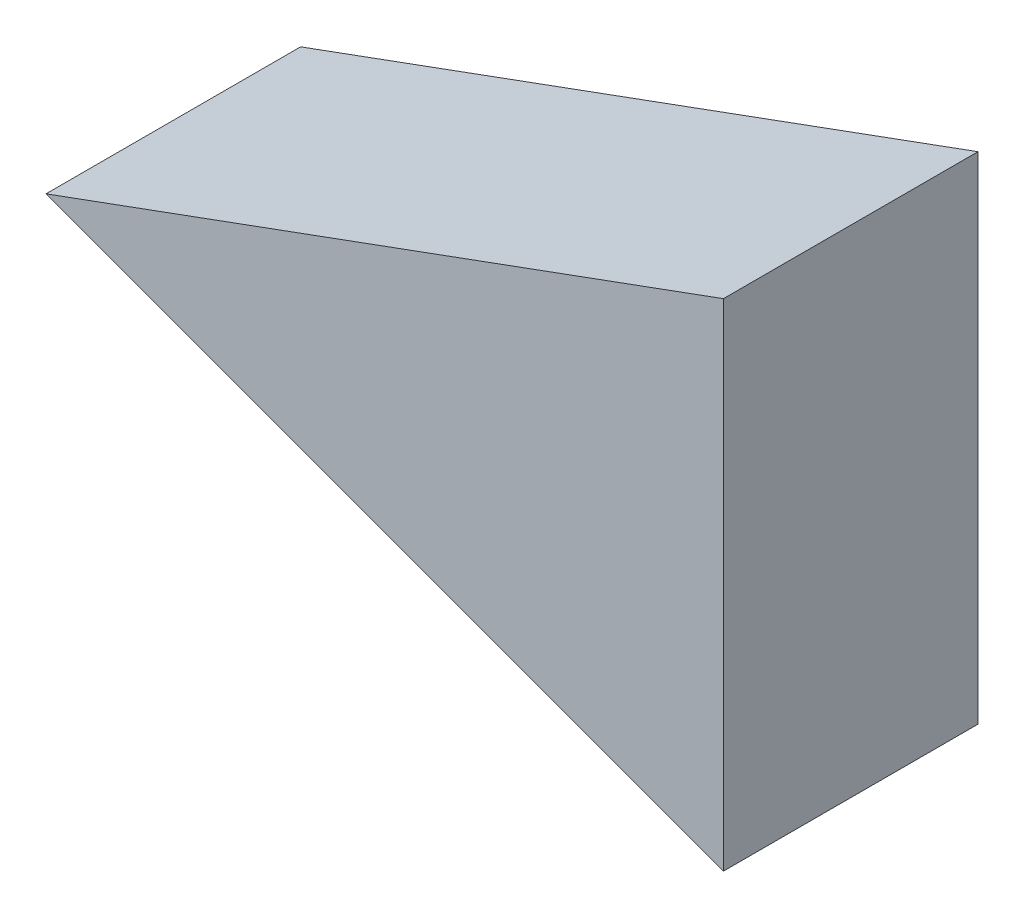
ISO-10303-21;
HEADER;
FILE_DESCRIPTION(('STEP AP214'),'2;1');
FILE_NAME('part.step','',(''),(''),'','','');
FILE_SCHEMA(('AUTOMOTIVE_DESIGN { 1 0 10303 214 1 1 1 1 }'));
ENDSEC;
DATA;
#1=APPLICATION_CONTEXT('core data for automotive mechanical design processes');
#2=APPLICATION_PROTOCOL_DEFINITION('international standard','automotive_design',2000,#1);
#3=PRODUCT_CONTEXT('',#1,'mechanical');
#4=PRODUCT('Part','Part','',(#3));
#5=PRODUCT_RELATED_PRODUCT_CATEGORY('part','',(#4));
#6=PRODUCT_DEFINITION_FORMATION('','',#4);
#7=PRODUCT_DEFINITION_CONTEXT('part definition',#1,'design');
#8=PRODUCT_DEFINITION('design','',#6,#7);
#9=PRODUCT_DEFINITION_SHAPE('','',#8);
#10=(LENGTH_UNIT() NAMED_UNIT(*) SI_UNIT(.MILLI.,.METRE.));
#11=(NAMED_UNIT(*) PLANE_ANGLE_UNIT() SI_UNIT($,.RADIAN.));
#12=(NAMED_UNIT(*) SI_UNIT($,.STERADIAN.) SOLID_ANGLE_UNIT());
#13=UNCERTAINTY_MEASURE_WITH_UNIT(LENGTH_MEASURE(1.E-05),#10,'distance_accuracy_value','');
#14=(GEOMETRIC_REPRESENTATION_CONTEXT(3) GLOBAL_UNCERTAINTY_ASSIGNED_CONTEXT((#13)) GLOBAL_UNIT_ASSIGNED_CONTEXT((#10,
#11,#12)) REPRESENTATION_CONTEXT('',''));
#15=CARTESIAN_POINT('',(0.,0.,0.));
#16=DIRECTION('',(0.,0.,1.));
#17=DIRECTION('',(1.,0.,0.));
#18=AXIS2_PLACEMENT_3D('',#15,#16,#17);
#19=CARTESIAN_POINT('',(-0.251518962578742,-1.29777679734156,0.));
#20=DIRECTION('',(1.,0.,0.));
#21=DIRECTION('',(0.,1.,0.));
#22=AXIS2_PLACEMENT_3D('',#19,#20,#21);
#23=PLANE('',#22);
#24=DIRECTION('',(0.,-1.,0.));
#25=VECTOR('',#24,1.);
#26=CARTESIAN_POINT('',(-0.251518962578742,-1.10302005482286,0.));
#27=LINE('',#26,#25);
#28=CARTESIAN_POINT('',(-0.251518962578742,-1.10302005482286,0.));
#29=VERTEX_POINT('',#28);
#30=CARTESIAN_POINT('',(-0.251518962578742,-1.29777679734156,0.));
#31=VERTEX_POINT('',#30);
#32=EDGE_CURVE('E11',#29,#31,#27,.T.);
#33=ORIENTED_EDGE('',*,*,#32,.F.);
#34=DIRECTION('',(0.,0.,1.));
#35=VECTOR('',#34,1.);
#36=CARTESIAN_POINT('',(-0.251518962578742,-1.10302005482286,0.));
#37=LINE('',#36,#35);
#38=CARTESIAN_POINT('',(-0.251518962578742,-1.10302005482286,0.1));
#39=VERTEX_POINT('',#38);
#40=EDGE_CURVE('E71',#29,#39,#37,.T.);
#41=ORIENTED_EDGE('',*,*,#40,.T.);
#42=DIRECTION('',(0.,1.,0.));
#43=VECTOR('',#42,1.);
#44=CARTESIAN_POINT('',(-0.251518962578742,-1.29777679734156,0.1));
#45=LINE('',#44,#43);
#46=CARTESIAN_POINT('',(-0.251518962578742,-1.29777679734156,0.1));
#47=VERTEX_POINT('',#46);
#48=EDGE_CURVE('E56',#47,#39,#45,.T.);
#49=ORIENTED_EDGE('',*,*,#48,.F.);
#50=DIRECTION('',(0.,0.,1.));
#51=VECTOR('',#50,1.);
#52=CARTESIAN_POINT('',(-0.251518962578742,-1.29777679734156,0.));
#53=LINE('',#52,#51);
#54=EDGE_CURVE('E61',#31,#47,#53,.T.);
#55=ORIENTED_EDGE('',*,*,#54,.F.);
#56=EDGE_LOOP('',(#33,#41,#49,#55));
#57=FACE_BOUND('',#56,.T.);
#58=ADVANCED_FACE('F17',(#57),#23,.T.);
#59=CARTESIAN_POINT('',(-0.517611616758224,-1.20039842608221,0.));
#60=DIRECTION('',(-0.34366681509704,-0.939091646326948,0.));
#61=DIRECTION('',(0.939091646326948,-0.34366681509704,0.));
#62=AXIS2_PLACEMENT_3D('',#59,#60,#61);
#63=PLANE('',#62);
#64=DIRECTION('',(-0.939091646326947,0.34366681509704,0.));
#65=VECTOR('',#64,1.);
#66=CARTESIAN_POINT('',(-0.251518962578741,-1.29777679734156,0.));
#67=LINE('',#66,#65);
#68=CARTESIAN_POINT('',(-0.517611616758224,-1.20039842608221,0.));
#69=VERTEX_POINT('',#68);
#70=EDGE_CURVE('E24',#31,#69,#67,.T.);
#71=ORIENTED_EDGE('',*,*,#70,.F.);
#72=ORIENTED_EDGE('',*,*,#54,.T.);
#73=DIRECTION('',(0.939091646326948,-0.343666815097038,0.));
#74=VECTOR('',#73,1.);
#75=CARTESIAN_POINT('',(-0.517611616758222,-1.20039842608221,0.1));
#76=LINE('',#75,#74);
#77=CARTESIAN_POINT('',(-0.517611616758224,-1.20039842608221,0.1));
#78=VERTEX_POINT('',#77);
#79=EDGE_CURVE('E57',#78,#47,#76,.T.);
#80=ORIENTED_EDGE('',*,*,#79,.F.);
#81=DIRECTION('',(0.,0.,1.));
#82=VECTOR('',#81,1.);
#83=CARTESIAN_POINT('',(-0.517611616758224,-1.20039842608221,0.));
#84=LINE('',#83,#82);
#85=EDGE_CURVE('E48',#69,#78,#84,.T.);
#86=ORIENTED_EDGE('',*,*,#85,.F.);
#87=EDGE_LOOP('',(#71,#72,#80,#86));
#88=FACE_BOUND('',#87,.T.);
#89=ADVANCED_FACE('F60',(#88),#63,.T.);
#90=CARTESIAN_POINT('',(-0.251518962578742,-1.10302005482286,0.));
#91=DIRECTION('',(-0.343666815097037,0.939091646326949,0.));
#92=DIRECTION('',(-0.939091646326949,-0.343666815097037,0.));
#93=AXIS2_PLACEMENT_3D('',#90,#91,#92);
#94=PLANE('',#93);
#95=DIRECTION('',(0.939091646326949,0.343666815097037,0.));
#96=VECTOR('',#95,1.);
#97=CARTESIAN_POINT('',(-0.517611616758224,-1.20039842608221,0.));
#98=LINE('',#97,#96);
#99=EDGE_CURVE('E55',#69,#29,#98,.T.);
#100=ORIENTED_EDGE('',*,*,#99,.F.);
#101=ORIENTED_EDGE('',*,*,#85,.T.);
#102=DIRECTION('',(-0.939091646326949,-0.343666815097037,0.));
#103=VECTOR('',#102,1.);
#104=CARTESIAN_POINT('',(-0.251518962578742,-1.10302005482286,0.1));
#105=LINE('',#104,#103);
#106=EDGE_CURVE('E53',#39,#78,#105,.T.);
#107=ORIENTED_EDGE('',*,*,#106,.F.);
#108=ORIENTED_EDGE('',*,*,#40,.F.);
#109=EDGE_LOOP('',(#100,#101,#107,#108));
#110=FACE_BOUND('',#109,.T.);
#111=ADVANCED_FACE('F50',(#110),#94,.T.);
#112=CARTESIAN_POINT('',(-0.350536312411954,-1.20039842608221,0.));
#113=DIRECTION('',(0.,0.,1.));
#114=DIRECTION('',(1.,0.,0.));
#115=AXIS2_PLACEMENT_3D('',#112,#113,#114);
#116=PLANE('',#115);
#117=ORIENTED_EDGE('',*,*,#99,.T.);
#118=ORIENTED_EDGE('',*,*,#32,.T.);
#119=ORIENTED_EDGE('',*,*,#70,.T.);
#120=EDGE_LOOP('',(#117,#118,#119));
#121=FACE_BOUND('',#120,.T.);
#122=ADVANCED_FACE('F73',(#121),#116,.F.);
#123=CARTESIAN_POINT('',(-0.350536312411954,-1.20039842608221,0.1));
#124=DIRECTION('',(0.,0.,1.));
#125=DIRECTION('',(1.,0.,0.));
#126=AXIS2_PLACEMENT_3D('',#123,#124,#125);
#127=PLANE('',#126);
#128=ORIENTED_EDGE('',*,*,#106,.T.);
#129=ORIENTED_EDGE('',*,*,#79,.T.);
#130=ORIENTED_EDGE('',*,*,#48,.T.);
#131=EDGE_LOOP('',(#128,#129,#130));
#132=FACE_BOUND('',#131,.T.);
#133=ADVANCED_FACE('F65',(#132),#127,.T.);
#134=CLOSED_SHELL('',(#58,#89,#111,#122,#133));
#135=MANIFOLD_SOLID_BREP('B1',#134);
#136=ADVANCED_BREP_SHAPE_REPRESENTATION('',(#18,#135),#14);
#137=SHAPE_DEFINITION_REPRESENTATION(#9,#136);
ENDSEC;
END-ISO-10303-21;
